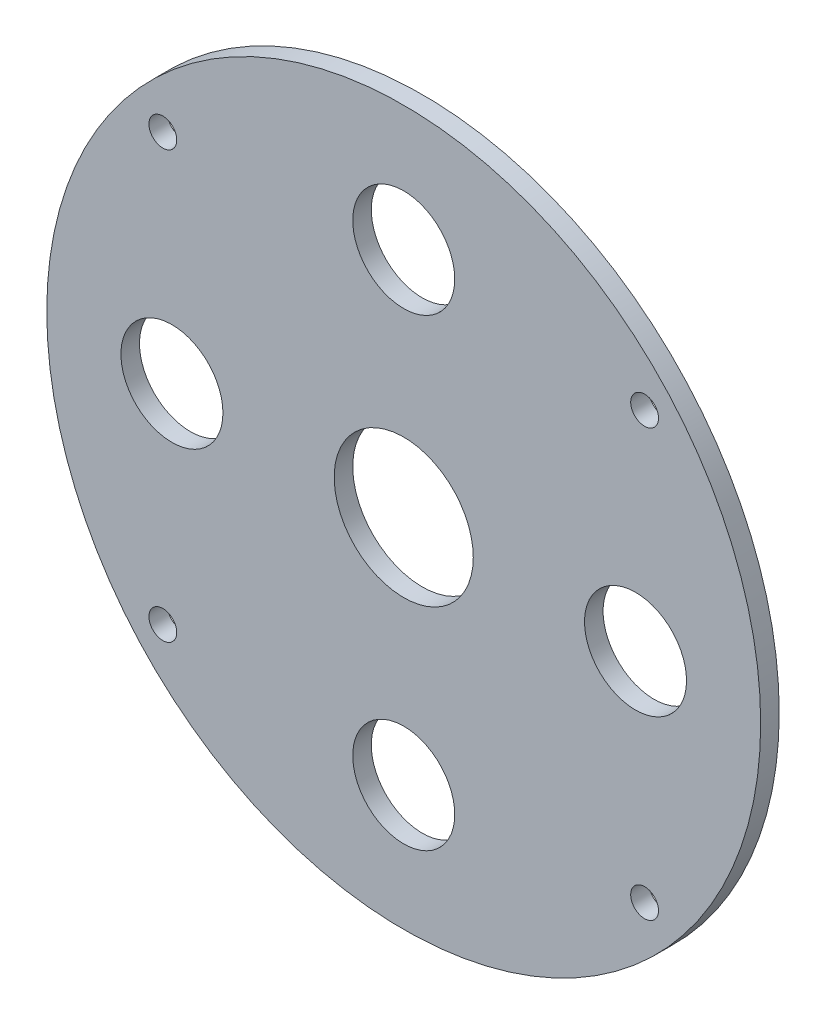
ISO-10303-21;
HEADER;
FILE_DESCRIPTION(('STEP AP214'),'2;1');
FILE_NAME('part.step','',(''),(''),'','','');
FILE_SCHEMA(('AUTOMOTIVE_DESIGN { 1 0 10303 214 1 1 1 1 }'));
ENDSEC;
DATA;
#1=APPLICATION_CONTEXT('core data for automotive mechanical design processes');
#2=APPLICATION_PROTOCOL_DEFINITION('international standard','automotive_design',2000,#1);
#3=PRODUCT_CONTEXT('',#1,'mechanical');
#4=PRODUCT('Part','Part','',(#3));
#5=PRODUCT_RELATED_PRODUCT_CATEGORY('part','',(#4));
#6=PRODUCT_DEFINITION_FORMATION('','',#4);
#7=PRODUCT_DEFINITION_CONTEXT('part definition',#1,'design');
#8=PRODUCT_DEFINITION('design','',#6,#7);
#9=PRODUCT_DEFINITION_SHAPE('','',#8);
#10=(LENGTH_UNIT() NAMED_UNIT(*) SI_UNIT(.MILLI.,.METRE.));
#11=(NAMED_UNIT(*) PLANE_ANGLE_UNIT() SI_UNIT($,.RADIAN.));
#12=(NAMED_UNIT(*) SI_UNIT($,.STERADIAN.) SOLID_ANGLE_UNIT());
#13=UNCERTAINTY_MEASURE_WITH_UNIT(LENGTH_MEASURE(1.E-05),#10,'distance_accuracy_value','');
#14=(GEOMETRIC_REPRESENTATION_CONTEXT(3) GLOBAL_UNCERTAINTY_ASSIGNED_CONTEXT((#13)) GLOBAL_UNIT_ASSIGNED_CONTEXT((#10,
#11,#12)) REPRESENTATION_CONTEXT('',''));
#15=CARTESIAN_POINT('',(0.,0.,0.));
#16=DIRECTION('',(0.,0.,1.));
#17=DIRECTION('',(1.,0.,0.));
#18=AXIS2_PLACEMENT_3D('',#15,#16,#17);
#19=CARTESIAN_POINT('',(0.,0.,2.));
#20=DIRECTION('',(0.,0.,1.));
#21=DIRECTION('',(1.,0.,0.));
#22=AXIS2_PLACEMENT_3D('',#19,#20,#21);
#23=PLANE('',#22);
#24=CARTESIAN_POINT('',(25.9807621135333,22.9999999999999,2.));
#25=DIRECTION('',(0.,0.,1.));
#26=DIRECTION('',(1.,0.,0.));
#27=AXIS2_PLACEMENT_3D('',#24,#25,#26);
#28=CIRCLE('',#27,1.50000000000006);
#29=CARTESIAN_POINT('',(27.4807621135333,22.9999999999999,2.));
#30=VERTEX_POINT('',#29);
#31=EDGE_CURVE('E84',#30,#30,#28,.T.);
#32=ORIENTED_EDGE('',*,*,#31,.F.);
#33=EDGE_LOOP('',(#32));
#34=FACE_BOUND('',#33,.T.);
#35=CARTESIAN_POINT('',(25.9807621135333,-23.0000000000001,2.));
#36=DIRECTION('',(0.,0.,1.));
#37=DIRECTION('',(1.,0.,0.));
#38=AXIS2_PLACEMENT_3D('',#35,#36,#37);
#39=CIRCLE('',#38,1.50000000000006);
#40=CARTESIAN_POINT('',(27.4807621135333,-23.0000000000001,2.));
#41=VERTEX_POINT('',#40);
#42=EDGE_CURVE('E72',#41,#41,#39,.T.);
#43=ORIENTED_EDGE('',*,*,#42,.F.);
#44=EDGE_LOOP('',(#43));
#45=FACE_BOUND('',#44,.T.);
#46=CARTESIAN_POINT('',(24.9999999999999,0.,2.));
#47=DIRECTION('',(0.,0.,1.));
#48=DIRECTION('',(1.,0.,0.));
#49=AXIS2_PLACEMENT_3D('',#46,#47,#48);
#50=CIRCLE('',#49,5.50000000000006);
#51=CARTESIAN_POINT('',(30.5,0.,2.));
#52=VERTEX_POINT('',#51);
#53=EDGE_CURVE('E60',#52,#52,#50,.T.);
#54=ORIENTED_EDGE('',*,*,#53,.F.);
#55=EDGE_LOOP('',(#54));
#56=FACE_BOUND('',#55,.T.);
#57=CARTESIAN_POINT('',(0.,24.9999999999999,2.));
#58=DIRECTION('',(0.,0.,1.));
#59=DIRECTION('',(1.,0.,0.));
#60=AXIS2_PLACEMENT_3D('',#57,#58,#59);
#61=CIRCLE('',#60,5.50000000000006);
#62=CARTESIAN_POINT('',(5.50000000000006,24.9999999999999,2.));
#63=VERTEX_POINT('',#62);
#64=EDGE_CURVE('E48',#63,#63,#61,.T.);
#65=ORIENTED_EDGE('',*,*,#64,.F.);
#66=EDGE_LOOP('',(#65));
#67=FACE_BOUND('',#66,.T.);
#68=CARTESIAN_POINT('',(0.,0.,2.));
#69=DIRECTION('',(0.,0.,1.));
#70=DIRECTION('',(1.,0.,0.));
#71=AXIS2_PLACEMENT_3D('',#68,#69,#70);
#72=CIRCLE('',#71,38.5);
#73=CARTESIAN_POINT('',(38.5,0.,2.));
#74=VERTEX_POINT('',#73);
#75=EDGE_CURVE('E10',#74,#74,#72,.T.);
#76=ORIENTED_EDGE('',*,*,#75,.T.);
#77=EDGE_LOOP('',(#76));
#78=FACE_BOUND('',#77,.T.);
#79=CARTESIAN_POINT('',(-24.9999999999999,0.,2.));
#80=DIRECTION('',(0.,0.,1.));
#81=DIRECTION('',(1.,0.,0.));
#82=AXIS2_PLACEMENT_3D('',#79,#80,#81);
#83=CIRCLE('',#82,5.50000000000006);
#84=CARTESIAN_POINT('',(-19.4999999999999,0.,2.));
#85=VERTEX_POINT('',#84);
#86=EDGE_CURVE('E43',#85,#85,#83,.T.);
#87=ORIENTED_EDGE('',*,*,#86,.F.);
#88=EDGE_LOOP('',(#87));
#89=FACE_BOUND('',#88,.T.);
#90=CARTESIAN_POINT('',(0.,-25.0000000000001,2.));
#91=DIRECTION('',(0.,0.,1.));
#92=DIRECTION('',(1.,0.,0.));
#93=AXIS2_PLACEMENT_3D('',#90,#91,#92);
#94=CIRCLE('',#93,5.50000000000006);
#95=CARTESIAN_POINT('',(5.50000000000006,-25.0000000000001,2.));
#96=VERTEX_POINT('',#95);
#97=EDGE_CURVE('E54',#96,#96,#94,.T.);
#98=ORIENTED_EDGE('',*,*,#97,.F.);
#99=EDGE_LOOP('',(#98));
#100=FACE_BOUND('',#99,.T.);
#101=CARTESIAN_POINT('',(0.,0.,2.));
#102=DIRECTION('',(0.,0.,1.));
#103=DIRECTION('',(1.,0.,0.));
#104=AXIS2_PLACEMENT_3D('',#101,#102,#103);
#105=CIRCLE('',#104,7.49999999999984);
#106=CARTESIAN_POINT('',(7.49999999999984,0.,2.));
#107=VERTEX_POINT('',#106);
#108=EDGE_CURVE('E66',#107,#107,#105,.T.);
#109=ORIENTED_EDGE('',*,*,#108,.F.);
#110=EDGE_LOOP('',(#109));
#111=FACE_BOUND('',#110,.T.);
#112=CARTESIAN_POINT('',(-25.9807621135306,-23.0000000000001,2.));
#113=DIRECTION('',(0.,0.,1.));
#114=DIRECTION('',(1.,0.,0.));
#115=AXIS2_PLACEMENT_3D('',#112,#113,#114);
#116=CIRCLE('',#115,1.50000000000006);
#117=CARTESIAN_POINT('',(-24.4807621135306,-23.0000000000001,2.));
#118=VERTEX_POINT('',#117);
#119=EDGE_CURVE('E78',#118,#118,#116,.T.);
#120=ORIENTED_EDGE('',*,*,#119,.F.);
#121=EDGE_LOOP('',(#120));
#122=FACE_BOUND('',#121,.T.);
#123=CARTESIAN_POINT('',(-25.9807621135306,22.9999999999999,2.));
#124=DIRECTION('',(0.,0.,1.));
#125=DIRECTION('',(1.,0.,0.));
#126=AXIS2_PLACEMENT_3D('',#123,#124,#125);
#127=CIRCLE('',#126,1.50000000000006);
#128=CARTESIAN_POINT('',(-24.4807621135306,22.9999999999999,2.));
#129=VERTEX_POINT('',#128);
#130=EDGE_CURVE('E90',#129,#129,#127,.T.);
#131=ORIENTED_EDGE('',*,*,#130,.F.);
#132=EDGE_LOOP('',(#131));
#133=FACE_BOUND('',#132,.T.);
#134=ADVANCED_FACE('F32',(#34,#45,#56,#67,#78,#89,#100,#111,#122,#133),#23,.T.);
#135=CARTESIAN_POINT('',(0.,0.,0.));
#136=DIRECTION('',(0.,0.,1.));
#137=DIRECTION('',(1.,0.,0.));
#138=AXIS2_PLACEMENT_3D('',#135,#136,#137);
#139=PLANE('',#138);
#140=CARTESIAN_POINT('',(25.9807621135333,22.9999999999999,0.));
#141=DIRECTION('',(0.,0.,1.));
#142=DIRECTION('',(1.,0.,0.));
#143=AXIS2_PLACEMENT_3D('',#140,#141,#142);
#144=CIRCLE('',#143,1.50000000000006);
#145=CARTESIAN_POINT('',(27.4807621135333,22.9999999999999,0.));
#146=VERTEX_POINT('',#145);
#147=EDGE_CURVE('E87',#146,#146,#144,.T.);
#148=ORIENTED_EDGE('',*,*,#147,.T.);
#149=EDGE_LOOP('',(#148));
#150=FACE_BOUND('',#149,.T.);
#151=CARTESIAN_POINT('',(25.9807621135333,-23.0000000000001,0.));
#152=DIRECTION('',(0.,0.,1.));
#153=DIRECTION('',(1.,0.,0.));
#154=AXIS2_PLACEMENT_3D('',#151,#152,#153);
#155=CIRCLE('',#154,1.50000000000006);
#156=CARTESIAN_POINT('',(27.4807621135333,-23.0000000000001,0.));
#157=VERTEX_POINT('',#156);
#158=EDGE_CURVE('E75',#157,#157,#155,.T.);
#159=ORIENTED_EDGE('',*,*,#158,.T.);
#160=EDGE_LOOP('',(#159));
#161=FACE_BOUND('',#160,.T.);
#162=CARTESIAN_POINT('',(24.9999999999999,0.,0.));
#163=DIRECTION('',(0.,0.,1.));
#164=DIRECTION('',(1.,0.,0.));
#165=AXIS2_PLACEMENT_3D('',#162,#163,#164);
#166=CIRCLE('',#165,5.50000000000006);
#167=CARTESIAN_POINT('',(30.5,0.,0.));
#168=VERTEX_POINT('',#167);
#169=EDGE_CURVE('E63',#168,#168,#166,.T.);
#170=ORIENTED_EDGE('',*,*,#169,.T.);
#171=EDGE_LOOP('',(#170));
#172=FACE_BOUND('',#171,.T.);
#173=CARTESIAN_POINT('',(0.,24.9999999999999,0.));
#174=DIRECTION('',(0.,0.,1.));
#175=DIRECTION('',(1.,0.,0.));
#176=AXIS2_PLACEMENT_3D('',#173,#174,#175);
#177=CIRCLE('',#176,5.50000000000006);
#178=CARTESIAN_POINT('',(5.50000000000006,24.9999999999999,0.));
#179=VERTEX_POINT('',#178);
#180=EDGE_CURVE('E51',#179,#179,#177,.T.);
#181=ORIENTED_EDGE('',*,*,#180,.T.);
#182=EDGE_LOOP('',(#181));
#183=FACE_BOUND('',#182,.T.);
#184=CARTESIAN_POINT('',(0.,0.,0.));
#185=DIRECTION('',(0.,0.,1.));
#186=DIRECTION('',(1.,0.,0.));
#187=AXIS2_PLACEMENT_3D('',#184,#185,#186);
#188=CIRCLE('',#187,38.5);
#189=CARTESIAN_POINT('',(38.5,0.,0.));
#190=VERTEX_POINT('',#189);
#191=EDGE_CURVE('E36',#190,#190,#188,.T.);
#192=ORIENTED_EDGE('',*,*,#191,.F.);
#193=EDGE_LOOP('',(#192));
#194=FACE_BOUND('',#193,.T.);
#195=CARTESIAN_POINT('',(-24.9999999999999,0.,0.));
#196=DIRECTION('',(0.,0.,1.));
#197=DIRECTION('',(1.,0.,0.));
#198=AXIS2_PLACEMENT_3D('',#195,#196,#197);
#199=CIRCLE('',#198,5.50000000000006);
#200=CARTESIAN_POINT('',(-19.4999999999999,0.,0.));
#201=VERTEX_POINT('',#200);
#202=EDGE_CURVE('E45',#201,#201,#199,.T.);
#203=ORIENTED_EDGE('',*,*,#202,.T.);
#204=EDGE_LOOP('',(#203));
#205=FACE_BOUND('',#204,.T.);
#206=CARTESIAN_POINT('',(0.,-25.0000000000001,0.));
#207=DIRECTION('',(0.,0.,1.));
#208=DIRECTION('',(1.,0.,0.));
#209=AXIS2_PLACEMENT_3D('',#206,#207,#208);
#210=CIRCLE('',#209,5.50000000000006);
#211=CARTESIAN_POINT('',(5.50000000000006,-25.0000000000001,0.));
#212=VERTEX_POINT('',#211);
#213=EDGE_CURVE('E57',#212,#212,#210,.T.);
#214=ORIENTED_EDGE('',*,*,#213,.T.);
#215=EDGE_LOOP('',(#214));
#216=FACE_BOUND('',#215,.T.);
#217=CARTESIAN_POINT('',(0.,0.,0.));
#218=DIRECTION('',(0.,0.,1.));
#219=DIRECTION('',(1.,0.,0.));
#220=AXIS2_PLACEMENT_3D('',#217,#218,#219);
#221=CIRCLE('',#220,7.49999999999984);
#222=CARTESIAN_POINT('',(7.49999999999984,0.,0.));
#223=VERTEX_POINT('',#222);
#224=EDGE_CURVE('E69',#223,#223,#221,.T.);
#225=ORIENTED_EDGE('',*,*,#224,.T.);
#226=EDGE_LOOP('',(#225));
#227=FACE_BOUND('',#226,.T.);
#228=CARTESIAN_POINT('',(-25.9807621135306,-23.0000000000001,0.));
#229=DIRECTION('',(0.,0.,1.));
#230=DIRECTION('',(1.,0.,0.));
#231=AXIS2_PLACEMENT_3D('',#228,#229,#230);
#232=CIRCLE('',#231,1.50000000000006);
#233=CARTESIAN_POINT('',(-24.4807621135306,-23.0000000000001,0.));
#234=VERTEX_POINT('',#233);
#235=EDGE_CURVE('E81',#234,#234,#232,.T.);
#236=ORIENTED_EDGE('',*,*,#235,.T.);
#237=EDGE_LOOP('',(#236));
#238=FACE_BOUND('',#237,.T.);
#239=CARTESIAN_POINT('',(-25.9807621135306,22.9999999999999,0.));
#240=DIRECTION('',(0.,0.,1.));
#241=DIRECTION('',(1.,0.,0.));
#242=AXIS2_PLACEMENT_3D('',#239,#240,#241);
#243=CIRCLE('',#242,1.50000000000006);
#244=CARTESIAN_POINT('',(-24.4807621135306,22.9999999999999,0.));
#245=VERTEX_POINT('',#244);
#246=EDGE_CURVE('E93',#245,#245,#243,.T.);
#247=ORIENTED_EDGE('',*,*,#246,.T.);
#248=EDGE_LOOP('',(#247));
#249=FACE_BOUND('',#248,.T.);
#250=ADVANCED_FACE('F103',(#150,#161,#172,#183,#194,#205,#216,#227,#238,#249),#139,.F.);
#251=CARTESIAN_POINT('',(0.,0.,2.));
#252=DIRECTION('',(0.,0.,-1.));
#253=DIRECTION('',(-1.,0.,0.));
#254=AXIS2_PLACEMENT_3D('',#251,#252,#253);
#255=CYLINDRICAL_SURFACE('',#254,38.5);
#256=ORIENTED_EDGE('',*,*,#75,.F.);
#257=EDGE_LOOP('',(#256));
#258=FACE_BOUND('',#257,.T.);
#259=ORIENTED_EDGE('',*,*,#191,.T.);
#260=EDGE_LOOP('',(#259));
#261=FACE_BOUND('',#260,.T.);
#262=ADVANCED_FACE('F34',(#258,#261),#255,.T.);
#263=CARTESIAN_POINT('',(-24.9999999999999,0.,2.));
#264=DIRECTION('',(0.,0.,-1.));
#265=DIRECTION('',(-1.,0.,0.));
#266=AXIS2_PLACEMENT_3D('',#263,#264,#265);
#267=CYLINDRICAL_SURFACE('',#266,5.50000000000006);
#268=ORIENTED_EDGE('',*,*,#86,.T.);
#269=EDGE_LOOP('',(#268));
#270=FACE_BOUND('',#269,.T.);
#271=ORIENTED_EDGE('',*,*,#202,.F.);
#272=EDGE_LOOP('',(#271));
#273=FACE_BOUND('',#272,.T.);
#274=ADVANCED_FACE('F113',(#270,#273),#267,.F.);
#275=CARTESIAN_POINT('',(0.,24.9999999999999,2.));
#276=DIRECTION('',(0.,0.,-1.));
#277=DIRECTION('',(-1.,0.,0.));
#278=AXIS2_PLACEMENT_3D('',#275,#276,#277);
#279=CYLINDRICAL_SURFACE('',#278,5.50000000000006);
#280=ORIENTED_EDGE('',*,*,#64,.T.);
#281=EDGE_LOOP('',(#280));
#282=FACE_BOUND('',#281,.T.);
#283=ORIENTED_EDGE('',*,*,#180,.F.);
#284=EDGE_LOOP('',(#283));
#285=FACE_BOUND('',#284,.T.);
#286=ADVANCED_FACE('F116',(#282,#285),#279,.F.);
#287=CARTESIAN_POINT('',(0.,-25.0000000000001,2.));
#288=DIRECTION('',(0.,0.,-1.));
#289=DIRECTION('',(-1.,0.,0.));
#290=AXIS2_PLACEMENT_3D('',#287,#288,#289);
#291=CYLINDRICAL_SURFACE('',#290,5.50000000000006);
#292=ORIENTED_EDGE('',*,*,#97,.T.);
#293=EDGE_LOOP('',(#292));
#294=FACE_BOUND('',#293,.T.);
#295=ORIENTED_EDGE('',*,*,#213,.F.);
#296=EDGE_LOOP('',(#295));
#297=FACE_BOUND('',#296,.T.);
#298=ADVANCED_FACE('F120',(#294,#297),#291,.F.);
#299=CARTESIAN_POINT('',(24.9999999999999,0.,2.));
#300=DIRECTION('',(0.,0.,-1.));
#301=DIRECTION('',(-1.,0.,0.));
#302=AXIS2_PLACEMENT_3D('',#299,#300,#301);
#303=CYLINDRICAL_SURFACE('',#302,5.50000000000006);
#304=ORIENTED_EDGE('',*,*,#53,.T.);
#305=EDGE_LOOP('',(#304));
#306=FACE_BOUND('',#305,.T.);
#307=ORIENTED_EDGE('',*,*,#169,.F.);
#308=EDGE_LOOP('',(#307));
#309=FACE_BOUND('',#308,.T.);
#310=ADVANCED_FACE('F124',(#306,#309),#303,.F.);
#311=CARTESIAN_POINT('',(0.,0.,2.));
#312=DIRECTION('',(0.,0.,-1.));
#313=DIRECTION('',(-1.,0.,0.));
#314=AXIS2_PLACEMENT_3D('',#311,#312,#313);
#315=CYLINDRICAL_SURFACE('',#314,7.49999999999984);
#316=ORIENTED_EDGE('',*,*,#108,.T.);
#317=EDGE_LOOP('',(#316));
#318=FACE_BOUND('',#317,.T.);
#319=ORIENTED_EDGE('',*,*,#224,.F.);
#320=EDGE_LOOP('',(#319));
#321=FACE_BOUND('',#320,.T.);
#322=ADVANCED_FACE('F128',(#318,#321),#315,.F.);
#323=CARTESIAN_POINT('',(25.9807621135333,-23.0000000000001,2.));
#324=DIRECTION('',(0.,0.,-1.));
#325=DIRECTION('',(-1.,0.,0.));
#326=AXIS2_PLACEMENT_3D('',#323,#324,#325);
#327=CYLINDRICAL_SURFACE('',#326,1.50000000000006);
#328=ORIENTED_EDGE('',*,*,#42,.T.);
#329=EDGE_LOOP('',(#328));
#330=FACE_BOUND('',#329,.T.);
#331=ORIENTED_EDGE('',*,*,#158,.F.);
#332=EDGE_LOOP('',(#331));
#333=FACE_BOUND('',#332,.T.);
#334=ADVANCED_FACE('F132',(#330,#333),#327,.F.);
#335=CARTESIAN_POINT('',(-25.9807621135306,-23.0000000000001,2.));
#336=DIRECTION('',(0.,0.,-1.));
#337=DIRECTION('',(-1.,0.,0.));
#338=AXIS2_PLACEMENT_3D('',#335,#336,#337);
#339=CYLINDRICAL_SURFACE('',#338,1.50000000000006);
#340=ORIENTED_EDGE('',*,*,#119,.T.);
#341=EDGE_LOOP('',(#340));
#342=FACE_BOUND('',#341,.T.);
#343=ORIENTED_EDGE('',*,*,#235,.F.);
#344=EDGE_LOOP('',(#343));
#345=FACE_BOUND('',#344,.T.);
#346=ADVANCED_FACE('F136',(#342,#345),#339,.F.);
#347=CARTESIAN_POINT('',(25.9807621135333,22.9999999999999,2.));
#348=DIRECTION('',(0.,0.,-1.));
#349=DIRECTION('',(-1.,0.,0.));
#350=AXIS2_PLACEMENT_3D('',#347,#348,#349);
#351=CYLINDRICAL_SURFACE('',#350,1.50000000000006);
#352=ORIENTED_EDGE('',*,*,#31,.T.);
#353=EDGE_LOOP('',(#352));
#354=FACE_BOUND('',#353,.T.);
#355=ORIENTED_EDGE('',*,*,#147,.F.);
#356=EDGE_LOOP('',(#355));
#357=FACE_BOUND('',#356,.T.);
#358=ADVANCED_FACE('F140',(#354,#357),#351,.F.);
#359=CARTESIAN_POINT('',(-25.9807621135306,22.9999999999999,2.));
#360=DIRECTION('',(0.,0.,-1.));
#361=DIRECTION('',(-1.,0.,0.));
#362=AXIS2_PLACEMENT_3D('',#359,#360,#361);
#363=CYLINDRICAL_SURFACE('',#362,1.50000000000006);
#364=ORIENTED_EDGE('',*,*,#130,.T.);
#365=EDGE_LOOP('',(#364));
#366=FACE_BOUND('',#365,.T.);
#367=ORIENTED_EDGE('',*,*,#246,.F.);
#368=EDGE_LOOP('',(#367));
#369=FACE_BOUND('',#368,.T.);
#370=ADVANCED_FACE('F99',(#366,#369),#363,.F.);
#371=CLOSED_SHELL('',(#134,#250,#262,#274,#286,#298,#310,#322,#334,#346,#358,#370));
#372=MANIFOLD_SOLID_BREP('B2',#371);
#373=ADVANCED_BREP_SHAPE_REPRESENTATION('',(#18,#372),#14);
#374=SHAPE_DEFINITION_REPRESENTATION(#9,#373);
ENDSEC;
END-ISO-10303-21;
